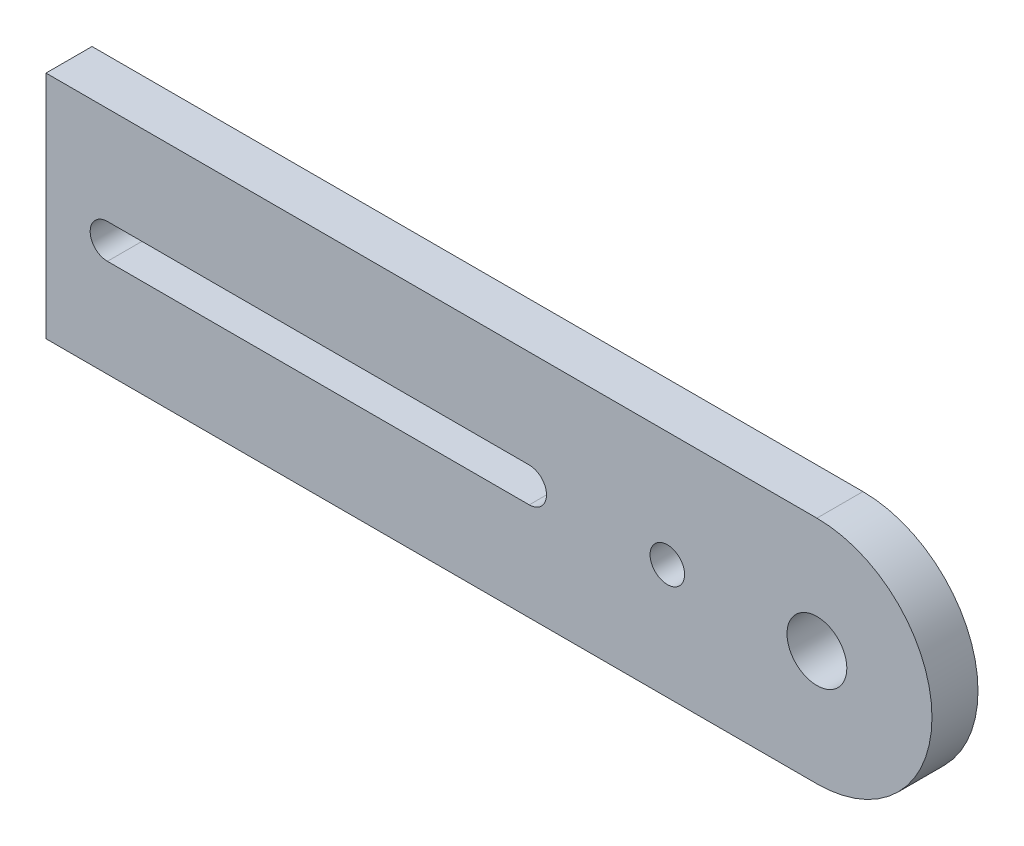
ISO-10303-21;
HEADER;
FILE_DESCRIPTION(('STEP AP214'),'2;1');
FILE_NAME('part.step','',(''),(''),'','','');
FILE_SCHEMA(('AUTOMOTIVE_DESIGN { 1 0 10303 214 1 1 1 1 }'));
ENDSEC;
DATA;
#1=APPLICATION_CONTEXT('core data for automotive mechanical design processes');
#2=APPLICATION_PROTOCOL_DEFINITION('international standard','automotive_design',2000,#1);
#3=PRODUCT_CONTEXT('',#1,'mechanical');
#4=PRODUCT('Part','Part','',(#3));
#5=PRODUCT_RELATED_PRODUCT_CATEGORY('part','',(#4));
#6=PRODUCT_DEFINITION_FORMATION('','',#4);
#7=PRODUCT_DEFINITION_CONTEXT('part definition',#1,'design');
#8=PRODUCT_DEFINITION('design','',#6,#7);
#9=PRODUCT_DEFINITION_SHAPE('','',#8);
#10=(LENGTH_UNIT() NAMED_UNIT(*) SI_UNIT(.MILLI.,.METRE.));
#11=(NAMED_UNIT(*) PLANE_ANGLE_UNIT() SI_UNIT($,.RADIAN.));
#12=(NAMED_UNIT(*) SI_UNIT($,.STERADIAN.) SOLID_ANGLE_UNIT());
#13=UNCERTAINTY_MEASURE_WITH_UNIT(LENGTH_MEASURE(1.E-05),#10,'distance_accuracy_value','');
#14=(GEOMETRIC_REPRESENTATION_CONTEXT(3) GLOBAL_UNCERTAINTY_ASSIGNED_CONTEXT((#13)) GLOBAL_UNIT_ASSIGNED_CONTEXT((#10,
#11,#12)) REPRESENTATION_CONTEXT('',''));
#15=CARTESIAN_POINT('',(0.,0.,0.));
#16=DIRECTION('',(0.,0.,1.));
#17=DIRECTION('',(1.,0.,0.));
#18=AXIS2_PLACEMENT_3D('',#15,#16,#17);
#19=CARTESIAN_POINT('',(-46.6616253071539,0.,0.));
#20=DIRECTION('',(0.,0.,1.));
#21=DIRECTION('',(1.,0.,0.));
#22=AXIS2_PLACEMENT_3D('',#19,#20,#21);
#23=CYLINDRICAL_SURFACE('',#22,1.5);
#24=DIRECTION('',(0.,0.,1.));
#25=VECTOR('',#24,1.);
#26=CARTESIAN_POINT('',(-46.6616253071539,1.5,0.));
#27=LINE('',#26,#25);
#28=CARTESIAN_POINT('',(-46.6616253071539,1.5,0.));
#29=VERTEX_POINT('',#28);
#30=CARTESIAN_POINT('',(-46.6616253071539,1.5,4.));
#31=VERTEX_POINT('',#30);
#32=EDGE_CURVE('E367',#29,#31,#27,.T.);
#33=ORIENTED_EDGE('',*,*,#32,.T.);
#34=CARTESIAN_POINT('',(-46.6616253071539,0.,4.));
#35=DIRECTION('',(0.,0.,1.));
#36=DIRECTION('',(1.,0.,0.));
#37=AXIS2_PLACEMENT_3D('',#34,#35,#36);
#38=CIRCLE('',#37,1.5);
#39=CARTESIAN_POINT('',(-46.6616253071539,-1.5,4.));
#40=VERTEX_POINT('',#39);
#41=EDGE_CURVE('E207',#31,#40,#38,.T.);
#42=ORIENTED_EDGE('',*,*,#41,.T.);
#43=DIRECTION('',(0.,0.,1.));
#44=VECTOR('',#43,1.);
#45=CARTESIAN_POINT('',(-46.6616253071539,-1.5,0.));
#46=LINE('',#45,#44);
#47=CARTESIAN_POINT('',(-46.6616253071539,-1.5,0.));
#48=VERTEX_POINT('',#47);
#49=EDGE_CURVE('E119',#48,#40,#46,.T.);
#50=ORIENTED_EDGE('',*,*,#49,.F.);
#51=CARTESIAN_POINT('',(-46.6616253071539,0.,0.));
#52=DIRECTION('',(0.,0.,1.));
#53=DIRECTION('',(1.,0.,0.));
#54=AXIS2_PLACEMENT_3D('',#51,#52,#53);
#55=CIRCLE('',#54,1.5);
#56=EDGE_CURVE('E129',#29,#48,#55,.T.);
#57=ORIENTED_EDGE('',*,*,#56,.F.);
#58=EDGE_LOOP('',(#33,#42,#50,#57));
#59=FACE_BOUND('',#58,.T.);
#60=ADVANCED_FACE('F45',(#59),#23,.F.);
#61=CARTESIAN_POINT('',(0.,-10.,4.));
#62=DIRECTION('',(0.,1.,0.));
#63=DIRECTION('',(0.,0.,1.));
#64=AXIS2_PLACEMENT_3D('',#61,#62,#63);
#65=PLANE('',#64);
#66=DIRECTION('',(1.,0.,0.));
#67=VECTOR('',#66,1.);
#68=CARTESIAN_POINT('',(0.,-10.,4.));
#69=LINE('',#68,#67);
#70=CARTESIAN_POINT('',(-52.,-10.,4.));
#71=VERTEX_POINT('',#70);
#72=CARTESIAN_POINT('',(15.,-10.,4.));
#73=VERTEX_POINT('',#72);
#74=EDGE_CURVE('E162',#71,#73,#69,.T.);
#75=ORIENTED_EDGE('',*,*,#74,.F.);
#76=DIRECTION('',(0.,0.,1.));
#77=VECTOR('',#76,1.);
#78=CARTESIAN_POINT('',(-52.,-10.,0.));
#79=LINE('',#78,#77);
#80=CARTESIAN_POINT('',(-52.,-10.,0.));
#81=VERTEX_POINT('',#80);
#82=EDGE_CURVE('E157',#81,#71,#79,.T.);
#83=ORIENTED_EDGE('',*,*,#82,.F.);
#84=DIRECTION('',(1.,0.,0.));
#85=VECTOR('',#84,1.);
#86=CARTESIAN_POINT('',(0.,-10.,0.));
#87=LINE('',#86,#85);
#88=CARTESIAN_POINT('',(15.,-10.,0.));
#89=VERTEX_POINT('',#88);
#90=EDGE_CURVE('E160',#81,#89,#87,.T.);
#91=ORIENTED_EDGE('',*,*,#90,.T.);
#92=DIRECTION('',(0.,0.,-1.));
#93=VECTOR('',#92,1.);
#94=CARTESIAN_POINT('',(15.,-10.,4.));
#95=LINE('',#94,#93);
#96=EDGE_CURVE('E11',#73,#89,#95,.T.);
#97=ORIENTED_EDGE('',*,*,#96,.F.);
#98=EDGE_LOOP('',(#75,#83,#91,#97));
#99=FACE_BOUND('',#98,.T.);
#100=ADVANCED_FACE('F47',(#99),#65,.F.);
#101=CARTESIAN_POINT('',(15.,0.,4.));
#102=DIRECTION('',(0.,0.,-1.));
#103=DIRECTION('',(-1.,0.,0.));
#104=AXIS2_PLACEMENT_3D('',#101,#102,#103);
#105=CYLINDRICAL_SURFACE('',#104,10.);
#106=CARTESIAN_POINT('',(15.,0.,0.));
#107=DIRECTION('',(0.,0.,1.));
#108=DIRECTION('',(1.,0.,0.));
#109=AXIS2_PLACEMENT_3D('',#106,#107,#108);
#110=CIRCLE('',#109,10.);
#111=CARTESIAN_POINT('',(15.,10.,0.));
#112=VERTEX_POINT('',#111);
#113=EDGE_CURVE('E175',#89,#112,#110,.T.);
#114=ORIENTED_EDGE('',*,*,#113,.T.);
#115=DIRECTION('',(0.,0.,-1.));
#116=VECTOR('',#115,1.);
#117=CARTESIAN_POINT('',(15.,10.,4.));
#118=LINE('',#117,#116);
#119=CARTESIAN_POINT('',(15.,10.,4.));
#120=VERTEX_POINT('',#119);
#121=EDGE_CURVE('E54',#120,#112,#118,.T.);
#122=ORIENTED_EDGE('',*,*,#121,.F.);
#123=CARTESIAN_POINT('',(15.,0.,4.));
#124=DIRECTION('',(0.,0.,1.));
#125=DIRECTION('',(1.,0.,0.));
#126=AXIS2_PLACEMENT_3D('',#123,#124,#125);
#127=CIRCLE('',#126,10.);
#128=EDGE_CURVE('E165',#73,#120,#127,.T.);
#129=ORIENTED_EDGE('',*,*,#128,.F.);
#130=ORIENTED_EDGE('',*,*,#96,.T.);
#131=EDGE_LOOP('',(#114,#122,#129,#130));
#132=FACE_BOUND('',#131,.T.);
#133=ADVANCED_FACE('F190',(#132),#105,.T.);
#134=CARTESIAN_POINT('',(0.,10.,4.));
#135=DIRECTION('',(0.,1.,0.));
#136=DIRECTION('',(0.,0.,1.));
#137=AXIS2_PLACEMENT_3D('',#134,#135,#136);
#138=PLANE('',#137);
#139=DIRECTION('',(1.,0.,0.));
#140=VECTOR('',#139,1.);
#141=CARTESIAN_POINT('',(0.,10.,0.));
#142=LINE('',#141,#140);
#143=CARTESIAN_POINT('',(-52.,9.99999999999999,0.));
#144=VERTEX_POINT('',#143);
#145=EDGE_CURVE('E166',#144,#112,#142,.T.);
#146=ORIENTED_EDGE('',*,*,#145,.F.);
#147=DIRECTION('',(0.,0.,1.));
#148=VECTOR('',#147,1.);
#149=CARTESIAN_POINT('',(-52.,9.99999999999999,0.));
#150=LINE('',#149,#148);
#151=CARTESIAN_POINT('',(-52.,9.99999999999999,4.));
#152=VERTEX_POINT('',#151);
#153=EDGE_CURVE('E147',#144,#152,#150,.T.);
#154=ORIENTED_EDGE('',*,*,#153,.T.);
#155=DIRECTION('',(1.,0.,0.));
#156=VECTOR('',#155,1.);
#157=CARTESIAN_POINT('',(0.,10.,4.));
#158=LINE('',#157,#156);
#159=EDGE_CURVE('E170',#152,#120,#158,.T.);
#160=ORIENTED_EDGE('',*,*,#159,.T.);
#161=ORIENTED_EDGE('',*,*,#121,.T.);
#162=EDGE_LOOP('',(#146,#154,#160,#161));
#163=FACE_BOUND('',#162,.T.);
#164=ADVANCED_FACE('F184',(#163),#138,.T.);
#165=CARTESIAN_POINT('',(0.,0.,4.));
#166=DIRECTION('',(0.,0.,1.));
#167=DIRECTION('',(1.,0.,0.));
#168=AXIS2_PLACEMENT_3D('',#165,#166,#167);
#169=PLANE('',#168);
#170=DIRECTION('',(-1.,0.,0.));
#171=VECTOR('',#170,1.);
#172=CARTESIAN_POINT('',(-46.6616253071539,1.5,4.));
#173=LINE('',#172,#171);
#174=CARTESIAN_POINT('',(-10.,1.5,4.));
#175=VERTEX_POINT('',#174);
#176=EDGE_CURVE('E61',#175,#31,#173,.T.);
#177=ORIENTED_EDGE('',*,*,#176,.F.);
#178=CARTESIAN_POINT('',(-10.,0.,4.));
#179=DIRECTION('',(0.,0.,1.));
#180=DIRECTION('',(1.,0.,0.));
#181=AXIS2_PLACEMENT_3D('',#178,#179,#180);
#182=CIRCLE('',#181,1.5);
#183=CARTESIAN_POINT('',(-10.,-1.5,4.));
#184=VERTEX_POINT('',#183);
#185=EDGE_CURVE('E137',#184,#175,#182,.T.);
#186=ORIENTED_EDGE('',*,*,#185,.F.);
#187=DIRECTION('',(1.,0.,0.));
#188=VECTOR('',#187,1.);
#189=CARTESIAN_POINT('',(-10.,-1.5,4.));
#190=LINE('',#189,#188);
#191=EDGE_CURVE('E112',#40,#184,#190,.T.);
#192=ORIENTED_EDGE('',*,*,#191,.F.);
#193=ORIENTED_EDGE('',*,*,#41,.F.);
#194=EDGE_LOOP('',(#177,#186,#192,#193));
#195=FACE_BOUND('',#194,.T.);
#196=ORIENTED_EDGE('',*,*,#159,.F.);
#197=DIRECTION('',(0.,-1.,0.));
#198=VECTOR('',#197,1.);
#199=CARTESIAN_POINT('',(-52.,9.99999999999999,4.));
#200=LINE('',#199,#198);
#201=EDGE_CURVE('E200',#152,#71,#200,.T.);
#202=ORIENTED_EDGE('',*,*,#201,.T.);
#203=ORIENTED_EDGE('',*,*,#74,.T.);
#204=ORIENTED_EDGE('',*,*,#128,.T.);
#205=EDGE_LOOP('',(#196,#202,#203,#204));
#206=FACE_BOUND('',#205,.T.);
#207=CARTESIAN_POINT('',(2.,0.,4.));
#208=DIRECTION('',(0.,0.,1.));
#209=DIRECTION('',(1.,0.,0.));
#210=AXIS2_PLACEMENT_3D('',#207,#208,#209);
#211=CIRCLE('',#210,1.5);
#212=CARTESIAN_POINT('',(3.5,0.,4.));
#213=VERTEX_POINT('',#212);
#214=EDGE_CURVE('E144',#213,#213,#211,.T.);
#215=ORIENTED_EDGE('',*,*,#214,.F.);
#216=EDGE_LOOP('',(#215));
#217=FACE_BOUND('',#216,.T.);
#218=CARTESIAN_POINT('',(15.,0.,4.));
#219=DIRECTION('',(0.,0.,1.));
#220=DIRECTION('',(1.,0.,0.));
#221=AXIS2_PLACEMENT_3D('',#218,#219,#220);
#222=CIRCLE('',#221,2.6);
#223=CARTESIAN_POINT('',(17.6,0.,4.));
#224=VERTEX_POINT('',#223);
#225=EDGE_CURVE('E136',#224,#224,#222,.T.);
#226=ORIENTED_EDGE('',*,*,#225,.F.);
#227=EDGE_LOOP('',(#226));
#228=FACE_BOUND('',#227,.T.);
#229=ADVANCED_FACE('F214',(#195,#206,#217,#228),#169,.T.);
#230=CARTESIAN_POINT('',(0.,0.,0.));
#231=DIRECTION('',(0.,0.,1.));
#232=DIRECTION('',(1.,0.,0.));
#233=AXIS2_PLACEMENT_3D('',#230,#231,#232);
#234=PLANE('',#233);
#235=CARTESIAN_POINT('',(-10.,0.,0.));
#236=DIRECTION('',(0.,0.,1.));
#237=DIRECTION('',(1.,0.,0.));
#238=AXIS2_PLACEMENT_3D('',#235,#236,#237);
#239=CIRCLE('',#238,1.5);
#240=CARTESIAN_POINT('',(-10.,-1.5,0.));
#241=VERTEX_POINT('',#240);
#242=CARTESIAN_POINT('',(-10.,1.5,0.));
#243=VERTEX_POINT('',#242);
#244=EDGE_CURVE('E127',#241,#243,#239,.T.);
#245=ORIENTED_EDGE('',*,*,#244,.T.);
#246=DIRECTION('',(-1.,0.,0.));
#247=VECTOR('',#246,1.);
#248=CARTESIAN_POINT('',(-46.6616253071539,1.5,0.));
#249=LINE('',#248,#247);
#250=EDGE_CURVE('E131',#243,#29,#249,.T.);
#251=ORIENTED_EDGE('',*,*,#250,.T.);
#252=ORIENTED_EDGE('',*,*,#56,.T.);
#253=DIRECTION('',(1.,0.,0.));
#254=VECTOR('',#253,1.);
#255=CARTESIAN_POINT('',(-10.,-1.5,0.));
#256=LINE('',#255,#254);
#257=EDGE_CURVE('E69',#48,#241,#256,.T.);
#258=ORIENTED_EDGE('',*,*,#257,.T.);
#259=EDGE_LOOP('',(#245,#251,#252,#258));
#260=FACE_BOUND('',#259,.T.);
#261=CARTESIAN_POINT('',(2.,0.,0.));
#262=DIRECTION('',(0.,0.,1.));
#263=DIRECTION('',(1.,0.,0.));
#264=AXIS2_PLACEMENT_3D('',#261,#262,#263);
#265=CIRCLE('',#264,1.5);
#266=CARTESIAN_POINT('',(3.5,0.,0.));
#267=VERTEX_POINT('',#266);
#268=EDGE_CURVE('E153',#267,#267,#265,.T.);
#269=ORIENTED_EDGE('',*,*,#268,.T.);
#270=EDGE_LOOP('',(#269));
#271=FACE_BOUND('',#270,.T.);
#272=CARTESIAN_POINT('',(15.,0.,0.));
#273=DIRECTION('',(0.,0.,1.));
#274=DIRECTION('',(1.,0.,0.));
#275=AXIS2_PLACEMENT_3D('',#272,#273,#274);
#276=CIRCLE('',#275,2.6);
#277=CARTESIAN_POINT('',(17.6,0.,0.));
#278=VERTEX_POINT('',#277);
#279=EDGE_CURVE('E142',#278,#278,#276,.T.);
#280=ORIENTED_EDGE('',*,*,#279,.T.);
#281=EDGE_LOOP('',(#280));
#282=FACE_BOUND('',#281,.T.);
#283=ORIENTED_EDGE('',*,*,#90,.F.);
#284=DIRECTION('',(0.,-1.,0.));
#285=VECTOR('',#284,1.);
#286=CARTESIAN_POINT('',(-52.,9.99999999999999,0.));
#287=LINE('',#286,#285);
#288=EDGE_CURVE('E196',#144,#81,#287,.T.);
#289=ORIENTED_EDGE('',*,*,#288,.F.);
#290=ORIENTED_EDGE('',*,*,#145,.T.);
#291=ORIENTED_EDGE('',*,*,#113,.F.);
#292=EDGE_LOOP('',(#283,#289,#290,#291));
#293=FACE_BOUND('',#292,.T.);
#294=ADVANCED_FACE('F124',(#260,#271,#282,#293),#234,.F.);
#295=CARTESIAN_POINT('',(15.,0.,0.));
#296=DIRECTION('',(0.,0.,1.));
#297=DIRECTION('',(1.,0.,0.));
#298=AXIS2_PLACEMENT_3D('',#295,#296,#297);
#299=CYLINDRICAL_SURFACE('',#298,2.6);
#300=ORIENTED_EDGE('',*,*,#279,.F.);
#301=EDGE_LOOP('',(#300));
#302=FACE_BOUND('',#301,.T.);
#303=ORIENTED_EDGE('',*,*,#225,.T.);
#304=EDGE_LOOP('',(#303));
#305=FACE_BOUND('',#304,.T.);
#306=ADVANCED_FACE('F237',(#302,#305),#299,.F.);
#307=CARTESIAN_POINT('',(2.,0.,0.));
#308=DIRECTION('',(0.,0.,1.));
#309=DIRECTION('',(1.,0.,0.));
#310=AXIS2_PLACEMENT_3D('',#307,#308,#309);
#311=CYLINDRICAL_SURFACE('',#310,1.5);
#312=ORIENTED_EDGE('',*,*,#268,.F.);
#313=EDGE_LOOP('',(#312));
#314=FACE_BOUND('',#313,.T.);
#315=ORIENTED_EDGE('',*,*,#214,.T.);
#316=EDGE_LOOP('',(#315));
#317=FACE_BOUND('',#316,.T.);
#318=ADVANCED_FACE('F234',(#314,#317),#311,.F.);
#319=CARTESIAN_POINT('',(-10.,0.,0.));
#320=DIRECTION('',(0.,0.,1.));
#321=DIRECTION('',(1.,0.,0.));
#322=AXIS2_PLACEMENT_3D('',#319,#320,#321);
#323=CYLINDRICAL_SURFACE('',#322,1.5);
#324=ORIENTED_EDGE('',*,*,#185,.T.);
#325=DIRECTION('',(0.,0.,1.));
#326=VECTOR('',#325,1.);
#327=CARTESIAN_POINT('',(-10.,1.5,0.));
#328=LINE('',#327,#326);
#329=EDGE_CURVE('E118',#243,#175,#328,.T.);
#330=ORIENTED_EDGE('',*,*,#329,.F.);
#331=ORIENTED_EDGE('',*,*,#244,.F.);
#332=DIRECTION('',(0.,0.,1.));
#333=VECTOR('',#332,1.);
#334=CARTESIAN_POINT('',(-10.,-1.5,0.));
#335=LINE('',#334,#333);
#336=EDGE_CURVE('E109',#241,#184,#335,.T.);
#337=ORIENTED_EDGE('',*,*,#336,.T.);
#338=EDGE_LOOP('',(#324,#330,#331,#337));
#339=FACE_BOUND('',#338,.T.);
#340=ADVANCED_FACE('F134',(#339),#323,.F.);
#341=CARTESIAN_POINT('',(-52.,9.99999999999999,0.));
#342=DIRECTION('',(-1.,0.,0.));
#343=DIRECTION('',(0.,0.,1.));
#344=AXIS2_PLACEMENT_3D('',#341,#342,#343);
#345=PLANE('',#344);
#346=ORIENTED_EDGE('',*,*,#201,.F.);
#347=ORIENTED_EDGE('',*,*,#153,.F.);
#348=ORIENTED_EDGE('',*,*,#288,.T.);
#349=ORIENTED_EDGE('',*,*,#82,.T.);
#350=EDGE_LOOP('',(#346,#347,#348,#349));
#351=FACE_BOUND('',#350,.T.);
#352=ADVANCED_FACE('F211',(#351),#345,.T.);
#353=CARTESIAN_POINT('',(-10.,-1.5,0.));
#354=DIRECTION('',(0.,-1.,0.));
#355=DIRECTION('',(1.,0.,0.));
#356=AXIS2_PLACEMENT_3D('',#353,#354,#355);
#357=PLANE('',#356);
#358=ORIENTED_EDGE('',*,*,#191,.T.);
#359=ORIENTED_EDGE('',*,*,#336,.F.);
#360=ORIENTED_EDGE('',*,*,#257,.F.);
#361=ORIENTED_EDGE('',*,*,#49,.T.);
#362=EDGE_LOOP('',(#358,#359,#360,#361));
#363=FACE_BOUND('',#362,.T.);
#364=ADVANCED_FACE('F110',(#363),#357,.F.);
#365=CARTESIAN_POINT('',(-46.6616253071539,1.5,0.));
#366=DIRECTION('',(0.,1.,0.));
#367=DIRECTION('',(-1.,0.,0.));
#368=AXIS2_PLACEMENT_3D('',#365,#366,#367);
#369=PLANE('',#368);
#370=ORIENTED_EDGE('',*,*,#176,.T.);
#371=ORIENTED_EDGE('',*,*,#32,.F.);
#372=ORIENTED_EDGE('',*,*,#250,.F.);
#373=ORIENTED_EDGE('',*,*,#329,.T.);
#374=EDGE_LOOP('',(#370,#371,#372,#373));
#375=FACE_BOUND('',#374,.T.);
#376=ADVANCED_FACE('F267',(#375),#369,.F.);
#377=CLOSED_SHELL('',(#60,#100,#133,#164,#229,#294,#306,#318,#340,#352,#364,#376));
#378=MANIFOLD_SOLID_BREP('B2',#377);
#379=ADVANCED_BREP_SHAPE_REPRESENTATION('',(#18,#378),#14);
#380=SHAPE_DEFINITION_REPRESENTATION(#9,#379);
ENDSEC;
END-ISO-10303-21;
